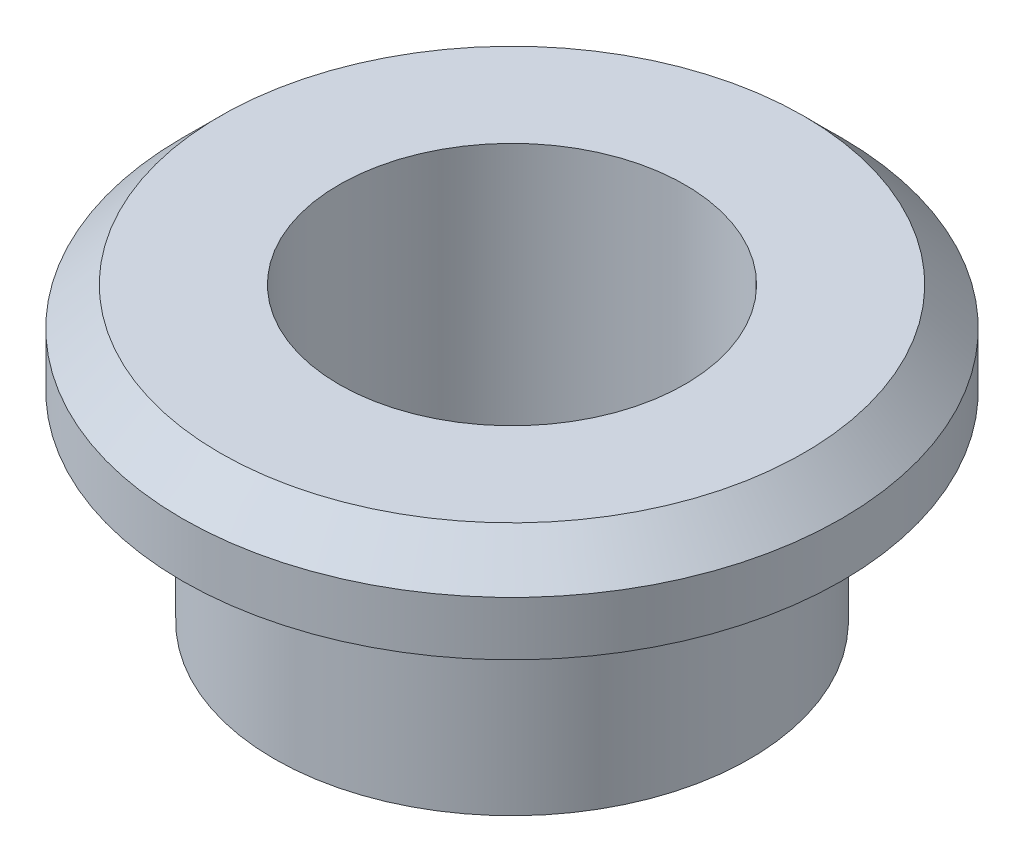
ISO-10303-21;
HEADER;
FILE_DESCRIPTION(('STEP AP214'),'2;1');
FILE_NAME('part.step','',(''),(''),'','','');
FILE_SCHEMA(('AUTOMOTIVE_DESIGN { 1 0 10303 214 1 1 1 1 }'));
ENDSEC;
DATA;
#1=APPLICATION_CONTEXT('core data for automotive mechanical design processes');
#2=APPLICATION_PROTOCOL_DEFINITION('international standard','automotive_design',2000,#1);
#3=PRODUCT_CONTEXT('',#1,'mechanical');
#4=PRODUCT('Part','Part','',(#3));
#5=PRODUCT_RELATED_PRODUCT_CATEGORY('part','',(#4));
#6=PRODUCT_DEFINITION_FORMATION('','',#4);
#7=PRODUCT_DEFINITION_CONTEXT('part definition',#1,'design');
#8=PRODUCT_DEFINITION('design','',#6,#7);
#9=PRODUCT_DEFINITION_SHAPE('','',#8);
#10=(LENGTH_UNIT() NAMED_UNIT(*) SI_UNIT(.MILLI.,.METRE.));
#11=(NAMED_UNIT(*) PLANE_ANGLE_UNIT() SI_UNIT($,.RADIAN.));
#12=(NAMED_UNIT(*) SI_UNIT($,.STERADIAN.) SOLID_ANGLE_UNIT());
#13=UNCERTAINTY_MEASURE_WITH_UNIT(LENGTH_MEASURE(1.E-05),#10,'distance_accuracy_value','');
#14=(GEOMETRIC_REPRESENTATION_CONTEXT(3) GLOBAL_UNCERTAINTY_ASSIGNED_CONTEXT((#13)) GLOBAL_UNIT_ASSIGNED_CONTEXT((#10,
#11,#12)) REPRESENTATION_CONTEXT('',''));
#15=CARTESIAN_POINT('',(0.,0.,0.));
#16=DIRECTION('',(0.,0.,1.));
#17=DIRECTION('',(1.,0.,0.));
#18=AXIS2_PLACEMENT_3D('',#15,#16,#17);
#19=CARTESIAN_POINT('',(1.6,0.,0.));
#20=DIRECTION('',(0.,1.,0.));
#21=DIRECTION('',(0.,0.,1.));
#22=AXIS2_PLACEMENT_3D('',#19,#20,#21);
#23=PLANE('',#22);
#24=CARTESIAN_POINT('',(0.,0.,0.));
#25=DIRECTION('',(0.,1.,0.));
#26=DIRECTION('',(0.,0.,1.));
#27=AXIS2_PLACEMENT_3D('',#24,#25,#26);
#28=CIRCLE('',#27,2.2);
#29=CARTESIAN_POINT('',(0.,0.,2.2));
#30=VERTEX_POINT('',#29);
#31=EDGE_CURVE('E10',#30,#30,#28,.T.);
#32=ORIENTED_EDGE('',*,*,#31,.F.);
#33=EDGE_LOOP('',(#32));
#34=FACE_BOUND('',#33,.T.);
#35=CARTESIAN_POINT('',(0.,0.,0.));
#36=DIRECTION('',(0.,1.,0.));
#37=DIRECTION('',(0.,0.,1.));
#38=AXIS2_PLACEMENT_3D('',#35,#36,#37);
#39=CIRCLE('',#38,1.6);
#40=CARTESIAN_POINT('',(0.,0.,1.6));
#41=VERTEX_POINT('',#40);
#42=EDGE_CURVE('E56',#41,#41,#39,.T.);
#43=ORIENTED_EDGE('',*,*,#42,.T.);
#44=EDGE_LOOP('',(#43));
#45=FACE_BOUND('',#44,.T.);
#46=ADVANCED_FACE('F31',(#34,#45),#23,.F.);
#47=CARTESIAN_POINT('',(0.,9.79114795561097,0.));
#48=DIRECTION('',(0.,1.,0.));
#49=DIRECTION('',(0.,0.,1.));
#50=AXIS2_PLACEMENT_3D('',#47,#48,#49);
#51=CYLINDRICAL_SURFACE('',#50,2.2);
#52=CARTESIAN_POINT('',(0.,1.85,0.));
#53=DIRECTION('',(0.,1.,0.));
#54=DIRECTION('',(0.,0.,1.));
#55=AXIS2_PLACEMENT_3D('',#52,#53,#54);
#56=CIRCLE('',#55,2.2);
#57=CARTESIAN_POINT('',(0.,1.85,2.2));
#58=VERTEX_POINT('',#57);
#59=EDGE_CURVE('E37',#58,#58,#56,.T.);
#60=ORIENTED_EDGE('',*,*,#59,.F.);
#61=EDGE_LOOP('',(#60));
#62=FACE_BOUND('',#61,.T.);
#63=ORIENTED_EDGE('',*,*,#31,.T.);
#64=EDGE_LOOP('',(#63));
#65=FACE_BOUND('',#64,.T.);
#66=ADVANCED_FACE('F87',(#62,#65),#51,.T.);
#67=CARTESIAN_POINT('',(2.2,1.85,0.));
#68=DIRECTION('',(0.,1.,0.));
#69=DIRECTION('',(0.,0.,1.));
#70=AXIS2_PLACEMENT_3D('',#67,#68,#69);
#71=PLANE('',#70);
#72=CARTESIAN_POINT('',(0.,1.85,0.));
#73=DIRECTION('',(0.,1.,0.));
#74=DIRECTION('',(0.,0.,1.));
#75=AXIS2_PLACEMENT_3D('',#72,#73,#74);
#76=CIRCLE('',#75,3.05);
#77=CARTESIAN_POINT('',(0.,1.85,3.05));
#78=VERTEX_POINT('',#77);
#79=EDGE_CURVE('E41',#78,#78,#76,.T.);
#80=ORIENTED_EDGE('',*,*,#79,.F.);
#81=EDGE_LOOP('',(#80));
#82=FACE_BOUND('',#81,.T.);
#83=ORIENTED_EDGE('',*,*,#59,.T.);
#84=EDGE_LOOP('',(#83));
#85=FACE_BOUND('',#84,.T.);
#86=ADVANCED_FACE('F82',(#82,#85),#71,.F.);
#87=CARTESIAN_POINT('',(0.,9.79114795561097,0.));
#88=DIRECTION('',(0.,1.,0.));
#89=DIRECTION('',(0.,0.,1.));
#90=AXIS2_PLACEMENT_3D('',#87,#88,#89);
#91=CYLINDRICAL_SURFACE('',#90,3.05);
#92=CARTESIAN_POINT('',(0.,2.35,0.));
#93=DIRECTION('',(0.,1.,0.));
#94=DIRECTION('',(0.,0.,1.));
#95=AXIS2_PLACEMENT_3D('',#92,#93,#94);
#96=CIRCLE('',#95,3.05);
#97=CARTESIAN_POINT('',(0.,2.35,3.05));
#98=VERTEX_POINT('',#97);
#99=EDGE_CURVE('E45',#98,#98,#96,.T.);
#100=ORIENTED_EDGE('',*,*,#99,.F.);
#101=EDGE_LOOP('',(#100));
#102=FACE_BOUND('',#101,.T.);
#103=ORIENTED_EDGE('',*,*,#79,.T.);
#104=EDGE_LOOP('',(#103));
#105=FACE_BOUND('',#104,.T.);
#106=ADVANCED_FACE('F76',(#102,#105),#91,.T.);
#107=CARTESIAN_POINT('',(0.,2.35,0.));
#108=DIRECTION('',(0.,-1.,0.));
#109=DIRECTION('',(0.,0.,-1.));
#110=AXIS2_PLACEMENT_3D('',#107,#108,#109);
#111=CONICAL_SURFACE('',#110,3.05,0.785398163397446);
#112=CARTESIAN_POINT('',(0.,2.7,0.));
#113=DIRECTION('',(0.,1.,0.));
#114=DIRECTION('',(0.,0.,1.));
#115=AXIS2_PLACEMENT_3D('',#112,#113,#114);
#116=CIRCLE('',#115,2.7);
#117=CARTESIAN_POINT('',(0.,2.7,2.7));
#118=VERTEX_POINT('',#117);
#119=EDGE_CURVE('E50',#118,#118,#116,.T.);
#120=ORIENTED_EDGE('',*,*,#119,.F.);
#121=EDGE_LOOP('',(#120));
#122=FACE_BOUND('',#121,.T.);
#123=ORIENTED_EDGE('',*,*,#99,.T.);
#124=EDGE_LOOP('',(#123));
#125=FACE_BOUND('',#124,.T.);
#126=ADVANCED_FACE('F70',(#122,#125),#111,.T.);
#127=CARTESIAN_POINT('',(2.7,2.7,0.));
#128=DIRECTION('',(0.,-1.,0.));
#129=DIRECTION('',(0.,0.,-1.));
#130=AXIS2_PLACEMENT_3D('',#127,#128,#129);
#131=PLANE('',#130);
#132=CARTESIAN_POINT('',(0.,2.7,0.));
#133=DIRECTION('',(0.,1.,0.));
#134=DIRECTION('',(0.,0.,1.));
#135=AXIS2_PLACEMENT_3D('',#132,#133,#134);
#136=CIRCLE('',#135,1.6);
#137=CARTESIAN_POINT('',(0.,2.7,1.6));
#138=VERTEX_POINT('',#137);
#139=EDGE_CURVE('E53',#138,#138,#136,.T.);
#140=ORIENTED_EDGE('',*,*,#139,.F.);
#141=EDGE_LOOP('',(#140));
#142=FACE_BOUND('',#141,.T.);
#143=ORIENTED_EDGE('',*,*,#119,.T.);
#144=EDGE_LOOP('',(#143));
#145=FACE_BOUND('',#144,.T.);
#146=ADVANCED_FACE('F64',(#142,#145),#131,.F.);
#147=CARTESIAN_POINT('',(0.,9.79114795561097,0.));
#148=DIRECTION('',(0.,1.,0.));
#149=DIRECTION('',(0.,0.,1.));
#150=AXIS2_PLACEMENT_3D('',#147,#148,#149);
#151=CYLINDRICAL_SURFACE('',#150,1.6);
#152=ORIENTED_EDGE('',*,*,#42,.F.);
#153=EDGE_LOOP('',(#152));
#154=FACE_BOUND('',#153,.T.);
#155=ORIENTED_EDGE('',*,*,#139,.T.);
#156=EDGE_LOOP('',(#155));
#157=FACE_BOUND('',#156,.T.);
#158=ADVANCED_FACE('F61',(#154,#157),#151,.F.);
#159=CLOSED_SHELL('',(#46,#66,#86,#106,#126,#146,#158));
#160=MANIFOLD_SOLID_BREP('B2',#159);
#161=ADVANCED_BREP_SHAPE_REPRESENTATION('',(#18,#160),#14);
#162=SHAPE_DEFINITION_REPRESENTATION(#9,#161);
ENDSEC;
END-ISO-10303-21;
